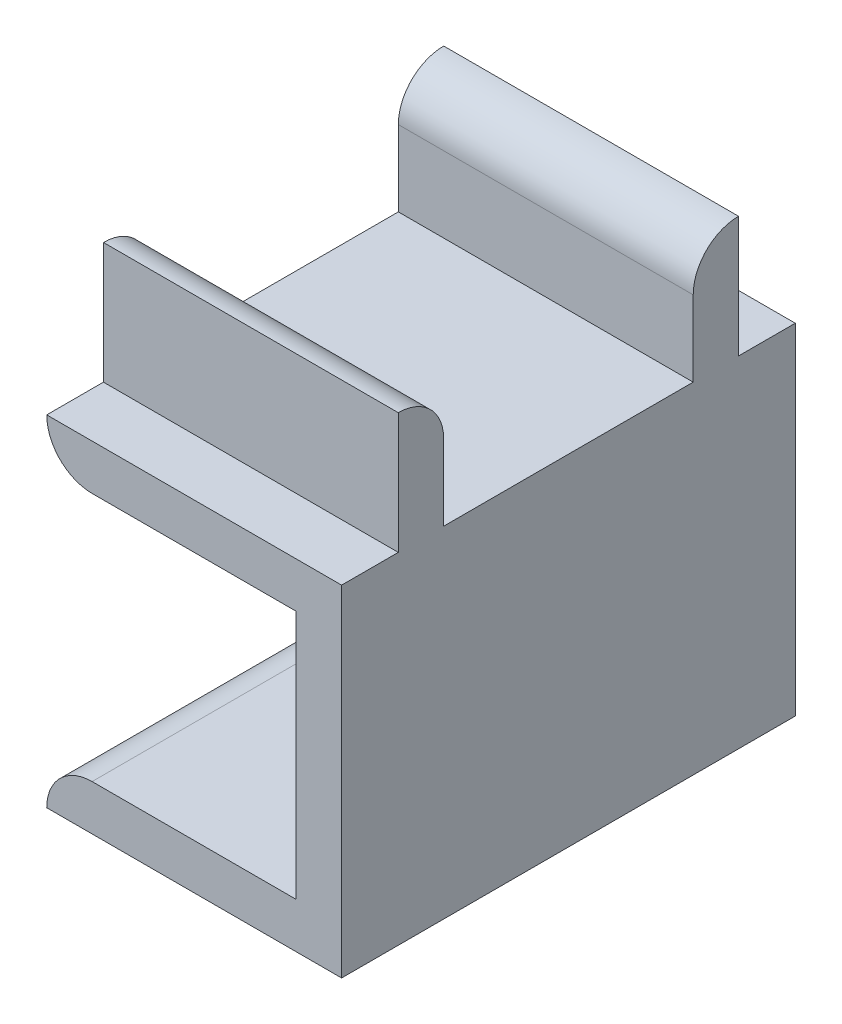
ISO-10303-21;
HEADER;
FILE_DESCRIPTION(('STEP AP214'),'2;1');
FILE_NAME('part.step','',(''),(''),'','','');
FILE_SCHEMA(('AUTOMOTIVE_DESIGN { 1 0 10303 214 1 1 1 1 }'));
ENDSEC;
DATA;
#1=APPLICATION_CONTEXT('core data for automotive mechanical design processes');
#2=APPLICATION_PROTOCOL_DEFINITION('international standard','automotive_design',2000,#1);
#3=PRODUCT_CONTEXT('',#1,'mechanical');
#4=PRODUCT('Part','Part','',(#3));
#5=PRODUCT_RELATED_PRODUCT_CATEGORY('part','',(#4));
#6=PRODUCT_DEFINITION_FORMATION('','',#4);
#7=PRODUCT_DEFINITION_CONTEXT('part definition',#1,'design');
#8=PRODUCT_DEFINITION('design','',#6,#7);
#9=PRODUCT_DEFINITION_SHAPE('','',#8);
#10=(LENGTH_UNIT() NAMED_UNIT(*) SI_UNIT(.MILLI.,.METRE.));
#11=(NAMED_UNIT(*) PLANE_ANGLE_UNIT() SI_UNIT($,.RADIAN.));
#12=(NAMED_UNIT(*) SI_UNIT($,.STERADIAN.) SOLID_ANGLE_UNIT());
#13=UNCERTAINTY_MEASURE_WITH_UNIT(LENGTH_MEASURE(1.E-05),#10,'distance_accuracy_value','');
#14=(GEOMETRIC_REPRESENTATION_CONTEXT(3) GLOBAL_UNCERTAINTY_ASSIGNED_CONTEXT((#13)) GLOBAL_UNIT_ASSIGNED_CONTEXT((#10,
#11,#12)) REPRESENTATION_CONTEXT('',''));
#15=CARTESIAN_POINT('',(0.,0.,0.));
#16=DIRECTION('',(0.,0.,1.));
#17=DIRECTION('',(1.,0.,0.));
#18=AXIS2_PLACEMENT_3D('',#15,#16,#17);
#19=CARTESIAN_POINT('',(-19.5,22.5,30.));
#20=DIRECTION('',(1.,0.,0.));
#21=DIRECTION('',(0.,0.,-1.));
#22=AXIS2_PLACEMENT_3D('',#19,#20,#21);
#23=PLANE('',#22);
#24=DIRECTION('',(0.,-1.,0.));
#25=VECTOR('',#24,1.);
#26=CARTESIAN_POINT('',(-19.5,30.5,3.75));
#27=LINE('',#26,#25);
#28=CARTESIAN_POINT('',(-19.5,30.5,3.75));
#29=VERTEX_POINT('',#28);
#30=CARTESIAN_POINT('',(-19.5,22.5,3.75));
#31=VERTEX_POINT('',#30);
#32=EDGE_CURVE('E198',#29,#31,#27,.T.);
#33=ORIENTED_EDGE('',*,*,#32,.T.);
#34=DIRECTION('',(0.,0.,-1.));
#35=VECTOR('',#34,1.);
#36=CARTESIAN_POINT('',(-19.5,22.5,30.));
#37=LINE('',#36,#35);
#38=CARTESIAN_POINT('',(-19.5,22.5,6.75));
#39=VERTEX_POINT('',#38);
#40=EDGE_CURVE('E237',#31,#39,#37,.F.);
#41=ORIENTED_EDGE('',*,*,#40,.T.);
#42=DIRECTION('',(0.,-1.,0.));
#43=VECTOR('',#42,1.);
#44=CARTESIAN_POINT('',(-19.5,30.5,6.75));
#45=LINE('',#44,#43);
#46=CARTESIAN_POINT('',(-19.5,27.5,6.75));
#47=VERTEX_POINT('',#46);
#48=EDGE_CURVE('E202',#47,#39,#45,.T.);
#49=ORIENTED_EDGE('',*,*,#48,.F.);
#50=CARTESIAN_POINT('',(-19.5,27.5,3.75));
#51=DIRECTION('',(1.,0.,0.));
#52=DIRECTION('',(0.,0.,-1.));
#53=AXIS2_PLACEMENT_3D('',#50,#51,#52);
#54=CIRCLE('',#53,3.);
#55=EDGE_CURVE('E155',#47,#29,#54,.F.);
#56=ORIENTED_EDGE('',*,*,#55,.T.);
#57=EDGE_LOOP('',(#33,#41,#49,#56));
#58=FACE_BOUND('',#57,.T.);
#59=ADVANCED_FACE('F33',(#58),#23,.F.);
#60=CARTESIAN_POINT('',(0.,22.5,30.));
#61=DIRECTION('',(0.,-1.,0.));
#62=DIRECTION('',(1.,0.,0.));
#63=AXIS2_PLACEMENT_3D('',#60,#61,#62);
#64=PLANE('',#63);
#65=DIRECTION('',(-1.,0.,0.));
#66=VECTOR('',#65,1.);
#67=CARTESIAN_POINT('',(0.,22.5,23.25));
#68=LINE('',#67,#66);
#69=CARTESIAN_POINT('',(0.,22.5,23.25));
#70=VERTEX_POINT('',#69);
#71=CARTESIAN_POINT('',(-19.5,22.5,23.25));
#72=VERTEX_POINT('',#71);
#73=EDGE_CURVE('E173',#70,#72,#68,.T.);
#74=ORIENTED_EDGE('',*,*,#73,.F.);
#75=DIRECTION('',(0.,0.,-1.));
#76=VECTOR('',#75,1.);
#77=CARTESIAN_POINT('',(0.,22.5,30.));
#78=LINE('',#77,#76);
#79=CARTESIAN_POINT('',(0.,22.5,6.75));
#80=VERTEX_POINT('',#79);
#81=EDGE_CURVE('E219',#70,#80,#78,.T.);
#82=ORIENTED_EDGE('',*,*,#81,.T.);
#83=DIRECTION('',(1.,0.,0.));
#84=VECTOR('',#83,1.);
#85=CARTESIAN_POINT('',(0.,22.5,6.75));
#86=LINE('',#85,#84);
#87=EDGE_CURVE('E186',#39,#80,#86,.T.);
#88=ORIENTED_EDGE('',*,*,#87,.F.);
#89=DIRECTION('',(0.,0.,-1.));
#90=VECTOR('',#89,1.);
#91=CARTESIAN_POINT('',(-19.5,22.5,30.));
#92=LINE('',#91,#90);
#93=EDGE_CURVE('E304',#72,#39,#92,.T.);
#94=ORIENTED_EDGE('',*,*,#93,.F.);
#95=EDGE_LOOP('',(#74,#82,#88,#94));
#96=FACE_BOUND('',#95,.T.);
#97=ADVANCED_FACE('F318',(#96),#64,.F.);
#98=DIRECTION('',(1.,0.,0.));
#99=VECTOR('',#98,1.);
#100=CARTESIAN_POINT('',(0.,22.5,26.25));
#101=LINE('',#100,#99);
#102=CARTESIAN_POINT('',(-19.5,22.5,26.25));
#103=VERTEX_POINT('',#102);
#104=CARTESIAN_POINT('',(0.,22.5,26.25));
#105=VERTEX_POINT('',#104);
#106=EDGE_CURVE('E170',#103,#105,#101,.T.);
#107=ORIENTED_EDGE('',*,*,#106,.F.);
#108=CARTESIAN_POINT('',(-19.5,22.5,30.));
#109=VERTEX_POINT('',#108);
#110=EDGE_CURVE('E303',#109,#103,#92,.T.);
#111=ORIENTED_EDGE('',*,*,#110,.F.);
#112=DIRECTION('',(-1.,0.,0.));
#113=VECTOR('',#112,1.);
#114=CARTESIAN_POINT('',(0.,22.5,30.));
#115=LINE('',#114,#113);
#116=CARTESIAN_POINT('',(0.,22.5,30.));
#117=VERTEX_POINT('',#116);
#118=EDGE_CURVE('E250',#117,#109,#115,.T.);
#119=ORIENTED_EDGE('',*,*,#118,.F.);
#120=EDGE_CURVE('E306',#117,#105,#78,.T.);
#121=ORIENTED_EDGE('',*,*,#120,.T.);
#122=EDGE_LOOP('',(#107,#111,#119,#121));
#123=FACE_BOUND('',#122,.T.);
#124=ADVANCED_FACE('F355',(#123),#64,.F.);
#125=DIRECTION('',(-1.,0.,0.));
#126=VECTOR('',#125,1.);
#127=CARTESIAN_POINT('',(0.,22.5,3.75));
#128=LINE('',#127,#126);
#129=CARTESIAN_POINT('',(0.,22.5,3.75));
#130=VERTEX_POINT('',#129);
#131=EDGE_CURVE('E181',#130,#31,#128,.T.);
#132=ORIENTED_EDGE('',*,*,#131,.F.);
#133=CARTESIAN_POINT('',(0.,22.5,0.));
#134=VERTEX_POINT('',#133);
#135=EDGE_CURVE('E195',#130,#134,#78,.T.);
#136=ORIENTED_EDGE('',*,*,#135,.T.);
#137=DIRECTION('',(-1.,0.,0.));
#138=VECTOR('',#137,1.);
#139=CARTESIAN_POINT('',(0.,22.5,0.));
#140=LINE('',#139,#138);
#141=CARTESIAN_POINT('',(-19.5,22.5,0.));
#142=VERTEX_POINT('',#141);
#143=EDGE_CURVE('E270',#134,#142,#140,.T.);
#144=ORIENTED_EDGE('',*,*,#143,.T.);
#145=EDGE_CURVE('E266',#31,#142,#92,.T.);
#146=ORIENTED_EDGE('',*,*,#145,.F.);
#147=EDGE_LOOP('',(#132,#136,#144,#146));
#148=FACE_BOUND('',#147,.T.);
#149=ADVANCED_FACE('F274',(#148),#64,.F.);
#150=CARTESIAN_POINT('',(-19.5,0.,30.));
#151=DIRECTION('',(0.,1.,0.));
#152=DIRECTION('',(0.,0.,1.));
#153=AXIS2_PLACEMENT_3D('',#150,#151,#152);
#154=PLANE('',#153);
#155=DIRECTION('',(1.,0.,0.));
#156=VECTOR('',#155,1.);
#157=CARTESIAN_POINT('',(-19.5,0.,0.));
#158=LINE('',#157,#156);
#159=CARTESIAN_POINT('',(-19.5,0.,0.));
#160=VERTEX_POINT('',#159);
#161=CARTESIAN_POINT('',(0.,0.,0.));
#162=VERTEX_POINT('',#161);
#163=EDGE_CURVE('E207',#160,#162,#158,.T.);
#164=ORIENTED_EDGE('',*,*,#163,.T.);
#165=DIRECTION('',(0.,0.,-1.));
#166=VECTOR('',#165,1.);
#167=CARTESIAN_POINT('',(0.,0.,30.));
#168=LINE('',#167,#166);
#169=CARTESIAN_POINT('',(0.,0.,30.));
#170=VERTEX_POINT('',#169);
#171=EDGE_CURVE('E223',#170,#162,#168,.T.);
#172=ORIENTED_EDGE('',*,*,#171,.F.);
#173=DIRECTION('',(1.,0.,0.));
#174=VECTOR('',#173,1.);
#175=CARTESIAN_POINT('',(-19.5,0.,30.));
#176=LINE('',#175,#174);
#177=CARTESIAN_POINT('',(-19.5,0.,30.));
#178=VERTEX_POINT('',#177);
#179=EDGE_CURVE('E287',#178,#170,#176,.T.);
#180=ORIENTED_EDGE('',*,*,#179,.F.);
#181=DIRECTION('',(0.,0.,-1.));
#182=VECTOR('',#181,1.);
#183=CARTESIAN_POINT('',(-19.5,0.,30.));
#184=LINE('',#183,#182);
#185=EDGE_CURVE('E288',#178,#160,#184,.T.);
#186=ORIENTED_EDGE('',*,*,#185,.T.);
#187=EDGE_LOOP('',(#164,#172,#180,#186));
#188=FACE_BOUND('',#187,.T.);
#189=ADVANCED_FACE('F347',(#188),#154,.F.);
#190=CARTESIAN_POINT('',(0.,0.,30.));
#191=DIRECTION('',(-1.,0.,0.));
#192=DIRECTION('',(0.,0.,1.));
#193=AXIS2_PLACEMENT_3D('',#190,#191,#192);
#194=PLANE('',#193);
#195=DIRECTION('',(0.,-1.,0.));
#196=VECTOR('',#195,1.);
#197=CARTESIAN_POINT('',(0.,30.5,23.25));
#198=LINE('',#197,#196);
#199=CARTESIAN_POINT('',(0.,27.5,23.25));
#200=VERTEX_POINT('',#199);
#201=EDGE_CURVE('E179',#200,#70,#198,.T.);
#202=ORIENTED_EDGE('',*,*,#201,.F.);
#203=CARTESIAN_POINT('',(0.,27.5,26.25));
#204=DIRECTION('',(-1.,0.,0.));
#205=DIRECTION('',(0.,0.,1.));
#206=AXIS2_PLACEMENT_3D('',#203,#204,#205);
#207=CIRCLE('',#206,3.);
#208=CARTESIAN_POINT('',(0.,30.5,26.25));
#209=VERTEX_POINT('',#208);
#210=EDGE_CURVE('E229',#200,#209,#207,.F.);
#211=ORIENTED_EDGE('',*,*,#210,.T.);
#212=DIRECTION('',(0.,-1.,0.));
#213=VECTOR('',#212,1.);
#214=CARTESIAN_POINT('',(0.,30.5,26.25));
#215=LINE('',#214,#213);
#216=EDGE_CURVE('E165',#209,#105,#215,.T.);
#217=ORIENTED_EDGE('',*,*,#216,.T.);
#218=ORIENTED_EDGE('',*,*,#120,.F.);
#219=DIRECTION('',(0.,1.,0.));
#220=VECTOR('',#219,1.);
#221=CARTESIAN_POINT('',(0.,0.,30.));
#222=LINE('',#221,#220);
#223=EDGE_CURVE('E342',#170,#117,#222,.T.);
#224=ORIENTED_EDGE('',*,*,#223,.F.);
#225=ORIENTED_EDGE('',*,*,#171,.T.);
#226=DIRECTION('',(0.,1.,0.));
#227=VECTOR('',#226,1.);
#228=CARTESIAN_POINT('',(0.,0.,0.));
#229=LINE('',#228,#227);
#230=EDGE_CURVE('E277',#162,#134,#229,.T.);
#231=ORIENTED_EDGE('',*,*,#230,.T.);
#232=ORIENTED_EDGE('',*,*,#135,.F.);
#233=DIRECTION('',(0.,-1.,0.));
#234=VECTOR('',#233,1.);
#235=CARTESIAN_POINT('',(0.,30.5,3.75));
#236=LINE('',#235,#234);
#237=CARTESIAN_POINT('',(0.,30.5,3.75));
#238=VERTEX_POINT('',#237);
#239=EDGE_CURVE('E201',#238,#130,#236,.T.);
#240=ORIENTED_EDGE('',*,*,#239,.F.);
#241=CARTESIAN_POINT('',(0.,27.5,3.75));
#242=DIRECTION('',(-1.,0.,0.));
#243=DIRECTION('',(0.,0.,1.));
#244=AXIS2_PLACEMENT_3D('',#241,#242,#243);
#245=CIRCLE('',#244,3.);
#246=CARTESIAN_POINT('',(0.,27.5,6.75));
#247=VERTEX_POINT('',#246);
#248=EDGE_CURVE('E220',#238,#247,#245,.F.);
#249=ORIENTED_EDGE('',*,*,#248,.T.);
#250=DIRECTION('',(0.,-1.,0.));
#251=VECTOR('',#250,1.);
#252=CARTESIAN_POINT('',(0.,30.5,6.75));
#253=LINE('',#252,#251);
#254=EDGE_CURVE('E185',#247,#80,#253,.T.);
#255=ORIENTED_EDGE('',*,*,#254,.T.);
#256=ORIENTED_EDGE('',*,*,#81,.F.);
#257=EDGE_LOOP('',(#202,#211,#217,#218,#224,#225,#231,#232,#240,#249,#255,#256));
#258=FACE_BOUND('',#257,.T.);
#259=ADVANCED_FACE('F336',(#258),#194,.F.);
#260=DIRECTION('',(0.,-1.,0.));
#261=VECTOR('',#260,1.);
#262=CARTESIAN_POINT('',(-19.5,30.5,23.25));
#263=LINE('',#262,#261);
#264=CARTESIAN_POINT('',(-19.5,27.5,23.25));
#265=VERTEX_POINT('',#264);
#266=EDGE_CURVE('E164',#265,#72,#263,.T.);
#267=ORIENTED_EDGE('',*,*,#266,.T.);
#268=DIRECTION('',(0.,0.,-1.));
#269=VECTOR('',#268,1.);
#270=CARTESIAN_POINT('',(-19.5,22.5,30.));
#271=LINE('',#270,#269);
#272=EDGE_CURVE('E161',#72,#103,#271,.F.);
#273=ORIENTED_EDGE('',*,*,#272,.T.);
#274=DIRECTION('',(0.,-1.,0.));
#275=VECTOR('',#274,1.);
#276=CARTESIAN_POINT('',(-19.5,30.5,26.25));
#277=LINE('',#276,#275);
#278=CARTESIAN_POINT('',(-19.5,30.5,26.25));
#279=VERTEX_POINT('',#278);
#280=EDGE_CURVE('E158',#279,#103,#277,.T.);
#281=ORIENTED_EDGE('',*,*,#280,.F.);
#282=CARTESIAN_POINT('',(-19.5,27.5,26.25));
#283=DIRECTION('',(1.,0.,0.));
#284=DIRECTION('',(0.,0.,-1.));
#285=AXIS2_PLACEMENT_3D('',#282,#283,#284);
#286=CIRCLE('',#285,3.);
#287=EDGE_CURVE('E146',#279,#265,#286,.F.);
#288=ORIENTED_EDGE('',*,*,#287,.T.);
#289=EDGE_LOOP('',(#267,#273,#281,#288));
#290=FACE_BOUND('',#289,.T.);
#291=ADVANCED_FACE('F159',(#290),#23,.F.);
#292=CARTESIAN_POINT('',(-19.5,19.5,30.));
#293=DIRECTION('',(0.,1.,0.));
#294=DIRECTION('',(0.,0.,1.));
#295=AXIS2_PLACEMENT_3D('',#292,#293,#294);
#296=PLANE('',#295);
#297=DIRECTION('',(1.,0.,0.));
#298=VECTOR('',#297,1.);
#299=CARTESIAN_POINT('',(-19.5,19.5,30.));
#300=LINE('',#299,#298);
#301=CARTESIAN_POINT('',(-16.5,19.5,30.));
#302=VERTEX_POINT('',#301);
#303=CARTESIAN_POINT('',(-3.,19.5,30.));
#304=VERTEX_POINT('',#303);
#305=EDGE_CURVE('E247',#302,#304,#300,.T.);
#306=ORIENTED_EDGE('',*,*,#305,.F.);
#307=DIRECTION('',(0.,0.,-1.));
#308=VECTOR('',#307,1.);
#309=CARTESIAN_POINT('',(-16.5,19.5,30.));
#310=LINE('',#309,#308);
#311=CARTESIAN_POINT('',(-16.5,19.5,0.));
#312=VERTEX_POINT('',#311);
#313=EDGE_CURVE('E231',#302,#312,#310,.T.);
#314=ORIENTED_EDGE('',*,*,#313,.T.);
#315=DIRECTION('',(1.,0.,0.));
#316=VECTOR('',#315,1.);
#317=CARTESIAN_POINT('',(-19.5,19.5,0.));
#318=LINE('',#317,#316);
#319=CARTESIAN_POINT('',(-3.,19.5,0.));
#320=VERTEX_POINT('',#319);
#321=EDGE_CURVE('E272',#312,#320,#318,.T.);
#322=ORIENTED_EDGE('',*,*,#321,.T.);
#323=DIRECTION('',(0.,0.,-1.));
#324=VECTOR('',#323,1.);
#325=CARTESIAN_POINT('',(-3.,19.5,30.));
#326=LINE('',#325,#324);
#327=EDGE_CURVE('E259',#304,#320,#326,.T.);
#328=ORIENTED_EDGE('',*,*,#327,.F.);
#329=EDGE_LOOP('',(#306,#314,#322,#328));
#330=FACE_BOUND('',#329,.T.);
#331=ADVANCED_FACE('F256',(#330),#296,.F.);
#332=CARTESIAN_POINT('',(-3.,19.5,30.));
#333=DIRECTION('',(1.,0.,0.));
#334=DIRECTION('',(0.,1.,0.));
#335=AXIS2_PLACEMENT_3D('',#332,#333,#334);
#336=PLANE('',#335);
#337=DIRECTION('',(0.,-1.,0.));
#338=VECTOR('',#337,1.);
#339=CARTESIAN_POINT('',(-3.,19.5,0.));
#340=LINE('',#339,#338);
#341=CARTESIAN_POINT('',(-3.,3.,0.));
#342=VERTEX_POINT('',#341);
#343=EDGE_CURVE('E279',#320,#342,#340,.T.);
#344=ORIENTED_EDGE('',*,*,#343,.T.);
#345=DIRECTION('',(0.,0.,-1.));
#346=VECTOR('',#345,1.);
#347=CARTESIAN_POINT('',(-3.,3.,30.));
#348=LINE('',#347,#346);
#349=CARTESIAN_POINT('',(-3.,3.,30.));
#350=VERTEX_POINT('',#349);
#351=EDGE_CURVE('E291',#350,#342,#348,.T.);
#352=ORIENTED_EDGE('',*,*,#351,.F.);
#353=DIRECTION('',(0.,-1.,0.));
#354=VECTOR('',#353,1.);
#355=CARTESIAN_POINT('',(-3.,19.5,30.));
#356=LINE('',#355,#354);
#357=EDGE_CURVE('E261',#304,#350,#356,.T.);
#358=ORIENTED_EDGE('',*,*,#357,.F.);
#359=ORIENTED_EDGE('',*,*,#327,.T.);
#360=EDGE_LOOP('',(#344,#352,#358,#359));
#361=FACE_BOUND('',#360,.T.);
#362=ADVANCED_FACE('F368',(#361),#336,.F.);
#363=CARTESIAN_POINT('',(-3.,3.,30.));
#364=DIRECTION('',(0.,-1.,0.));
#365=DIRECTION('',(1.,0.,0.));
#366=AXIS2_PLACEMENT_3D('',#363,#364,#365);
#367=PLANE('',#366);
#368=DIRECTION('',(-1.,0.,0.));
#369=VECTOR('',#368,1.);
#370=CARTESIAN_POINT('',(-3.,3.,0.));
#371=LINE('',#370,#369);
#372=CARTESIAN_POINT('',(-16.5,3.,0.));
#373=VERTEX_POINT('',#372);
#374=EDGE_CURVE('E285',#342,#373,#371,.T.);
#375=ORIENTED_EDGE('',*,*,#374,.T.);
#376=DIRECTION('',(0.,0.,-1.));
#377=VECTOR('',#376,1.);
#378=CARTESIAN_POINT('',(-16.5,3.,30.));
#379=LINE('',#378,#377);
#380=CARTESIAN_POINT('',(-16.5,3.,30.));
#381=VERTEX_POINT('',#380);
#382=EDGE_CURVE('E41',#373,#381,#379,.F.);
#383=ORIENTED_EDGE('',*,*,#382,.T.);
#384=DIRECTION('',(-1.,0.,0.));
#385=VECTOR('',#384,1.);
#386=CARTESIAN_POINT('',(-3.,3.,30.));
#387=LINE('',#386,#385);
#388=EDGE_CURVE('E292',#350,#381,#387,.T.);
#389=ORIENTED_EDGE('',*,*,#388,.F.);
#390=ORIENTED_EDGE('',*,*,#351,.T.);
#391=EDGE_LOOP('',(#375,#383,#389,#390));
#392=FACE_BOUND('',#391,.T.);
#393=ADVANCED_FACE('F372',(#392),#367,.F.);
#394=CARTESIAN_POINT('',(0.,0.,30.));
#395=DIRECTION('',(0.,0.,1.));
#396=DIRECTION('',(1.,0.,0.));
#397=AXIS2_PLACEMENT_3D('',#394,#395,#396);
#398=PLANE('',#397);
#399=ORIENTED_EDGE('',*,*,#388,.T.);
#400=CARTESIAN_POINT('',(-16.5,0.,30.));
#401=DIRECTION('',(0.,0.,1.));
#402=DIRECTION('',(1.,0.,0.));
#403=AXIS2_PLACEMENT_3D('',#400,#401,#402);
#404=CIRCLE('',#403,3.);
#405=EDGE_CURVE('E11',#381,#178,#404,.T.);
#406=ORIENTED_EDGE('',*,*,#405,.T.);
#407=ORIENTED_EDGE('',*,*,#179,.T.);
#408=ORIENTED_EDGE('',*,*,#223,.T.);
#409=ORIENTED_EDGE('',*,*,#118,.T.);
#410=CARTESIAN_POINT('',(-16.5,22.5,30.));
#411=DIRECTION('',(0.,0.,1.));
#412=DIRECTION('',(1.,0.,0.));
#413=AXIS2_PLACEMENT_3D('',#410,#411,#412);
#414=CIRCLE('',#413,3.);
#415=EDGE_CURVE('E239',#109,#302,#414,.T.);
#416=ORIENTED_EDGE('',*,*,#415,.T.);
#417=ORIENTED_EDGE('',*,*,#305,.T.);
#418=ORIENTED_EDGE('',*,*,#357,.T.);
#419=EDGE_LOOP('',(#399,#406,#407,#408,#409,#416,#417,#418));
#420=FACE_BOUND('',#419,.T.);
#421=ADVANCED_FACE('F246',(#420),#398,.T.);
#422=CARTESIAN_POINT('',(0.,0.,0.));
#423=DIRECTION('',(0.,0.,1.));
#424=DIRECTION('',(1.,0.,0.));
#425=AXIS2_PLACEMENT_3D('',#422,#423,#424);
#426=PLANE('',#425);
#427=ORIENTED_EDGE('',*,*,#163,.F.);
#428=CARTESIAN_POINT('',(-16.5,0.,0.));
#429=DIRECTION('',(0.,0.,1.));
#430=DIRECTION('',(1.,0.,0.));
#431=AXIS2_PLACEMENT_3D('',#428,#429,#430);
#432=CIRCLE('',#431,3.);
#433=EDGE_CURVE('E55',#160,#373,#432,.F.);
#434=ORIENTED_EDGE('',*,*,#433,.T.);
#435=ORIENTED_EDGE('',*,*,#374,.F.);
#436=ORIENTED_EDGE('',*,*,#343,.F.);
#437=ORIENTED_EDGE('',*,*,#321,.F.);
#438=CARTESIAN_POINT('',(-16.5,22.5,0.));
#439=DIRECTION('',(0.,0.,1.));
#440=DIRECTION('',(1.,0.,0.));
#441=AXIS2_PLACEMENT_3D('',#438,#439,#440);
#442=CIRCLE('',#441,3.);
#443=EDGE_CURVE('E234',#312,#142,#442,.F.);
#444=ORIENTED_EDGE('',*,*,#443,.T.);
#445=ORIENTED_EDGE('',*,*,#143,.F.);
#446=ORIENTED_EDGE('',*,*,#230,.F.);
#447=EDGE_LOOP('',(#427,#434,#435,#436,#437,#444,#445,#446));
#448=FACE_BOUND('',#447,.T.);
#449=ADVANCED_FACE('F269',(#448),#426,.F.);
#450=CARTESIAN_POINT('',(0.,30.5,3.75));
#451=DIRECTION('',(0.,0.,1.));
#452=DIRECTION('',(1.,0.,0.));
#453=AXIS2_PLACEMENT_3D('',#450,#451,#452);
#454=PLANE('',#453);
#455=ORIENTED_EDGE('',*,*,#131,.T.);
#456=ORIENTED_EDGE('',*,*,#32,.F.);
#457=DIRECTION('',(-1.,0.,0.));
#458=VECTOR('',#457,1.);
#459=CARTESIAN_POINT('',(0.,30.5,3.75));
#460=LINE('',#459,#458);
#461=EDGE_CURVE('E182',#238,#29,#460,.T.);
#462=ORIENTED_EDGE('',*,*,#461,.F.);
#463=ORIENTED_EDGE('',*,*,#239,.T.);
#464=EDGE_LOOP('',(#455,#456,#462,#463));
#465=FACE_BOUND('',#464,.T.);
#466=ADVANCED_FACE('F335',(#465),#454,.F.);
#467=CARTESIAN_POINT('',(0.,30.5,6.75));
#468=DIRECTION('',(0.,0.,-1.));
#469=DIRECTION('',(-1.,0.,0.));
#470=AXIS2_PLACEMENT_3D('',#467,#468,#469);
#471=PLANE('',#470);
#472=ORIENTED_EDGE('',*,*,#254,.F.);
#473=DIRECTION('',(1.,0.,0.));
#474=VECTOR('',#473,1.);
#475=CARTESIAN_POINT('',(0.,27.5,6.75));
#476=LINE('',#475,#474);
#477=EDGE_CURVE('E222',#247,#47,#476,.F.);
#478=ORIENTED_EDGE('',*,*,#477,.T.);
#479=ORIENTED_EDGE('',*,*,#48,.T.);
#480=ORIENTED_EDGE('',*,*,#87,.T.);
#481=EDGE_LOOP('',(#472,#478,#479,#480));
#482=FACE_BOUND('',#481,.T.);
#483=ADVANCED_FACE('F324',(#482),#471,.F.);
#484=CARTESIAN_POINT('',(0.,30.5,23.25));
#485=DIRECTION('',(0.,0.,1.));
#486=DIRECTION('',(1.,0.,0.));
#487=AXIS2_PLACEMENT_3D('',#484,#485,#486);
#488=PLANE('',#487);
#489=ORIENTED_EDGE('',*,*,#266,.F.);
#490=DIRECTION('',(-1.,0.,0.));
#491=VECTOR('',#490,1.);
#492=CARTESIAN_POINT('',(0.,27.5,23.25));
#493=LINE('',#492,#491);
#494=EDGE_CURVE('E152',#265,#200,#493,.F.);
#495=ORIENTED_EDGE('',*,*,#494,.T.);
#496=ORIENTED_EDGE('',*,*,#201,.T.);
#497=ORIENTED_EDGE('',*,*,#73,.T.);
#498=EDGE_LOOP('',(#489,#495,#496,#497));
#499=FACE_BOUND('',#498,.T.);
#500=ADVANCED_FACE('F386',(#499),#488,.F.);
#501=CARTESIAN_POINT('',(0.,30.5,26.25));
#502=DIRECTION('',(0.,0.,-1.));
#503=DIRECTION('',(-1.,0.,0.));
#504=AXIS2_PLACEMENT_3D('',#501,#502,#503);
#505=PLANE('',#504);
#506=ORIENTED_EDGE('',*,*,#106,.T.);
#507=ORIENTED_EDGE('',*,*,#216,.F.);
#508=DIRECTION('',(1.,0.,0.));
#509=VECTOR('',#508,1.);
#510=CARTESIAN_POINT('',(0.,30.5,26.25));
#511=LINE('',#510,#509);
#512=EDGE_CURVE('E151',#279,#209,#511,.T.);
#513=ORIENTED_EDGE('',*,*,#512,.F.);
#514=ORIENTED_EDGE('',*,*,#280,.T.);
#515=EDGE_LOOP('',(#506,#507,#513,#514));
#516=FACE_BOUND('',#515,.T.);
#517=ADVANCED_FACE('F168',(#516),#505,.F.);
#518=CARTESIAN_POINT('',(0.,27.5,3.75));
#519=DIRECTION('',(1.,0.,0.));
#520=DIRECTION('',(0.,1.,0.));
#521=AXIS2_PLACEMENT_3D('',#518,#519,#520);
#522=CYLINDRICAL_SURFACE('',#521,3.);
#523=ORIENTED_EDGE('',*,*,#55,.F.);
#524=ORIENTED_EDGE('',*,*,#477,.F.);
#525=ORIENTED_EDGE('',*,*,#248,.F.);
#526=ORIENTED_EDGE('',*,*,#461,.T.);
#527=EDGE_LOOP('',(#523,#524,#525,#526));
#528=FACE_BOUND('',#527,.T.);
#529=ADVANCED_FACE('F331',(#528),#522,.T.);
#530=CARTESIAN_POINT('',(0.,27.5,26.25));
#531=DIRECTION('',(-1.,0.,0.));
#532=DIRECTION('',(0.,-1.,0.));
#533=AXIS2_PLACEMENT_3D('',#530,#531,#532);
#534=CYLINDRICAL_SURFACE('',#533,3.);
#535=ORIENTED_EDGE('',*,*,#210,.F.);
#536=ORIENTED_EDGE('',*,*,#494,.F.);
#537=ORIENTED_EDGE('',*,*,#287,.F.);
#538=ORIENTED_EDGE('',*,*,#512,.T.);
#539=EDGE_LOOP('',(#535,#536,#537,#538));
#540=FACE_BOUND('',#539,.T.);
#541=ADVANCED_FACE('F149',(#540),#534,.T.);
#542=CARTESIAN_POINT('',(-16.5,22.5,30.));
#543=DIRECTION('',(0.,0.,-1.));
#544=DIRECTION('',(-1.,0.,0.));
#545=AXIS2_PLACEMENT_3D('',#542,#543,#544);
#546=CYLINDRICAL_SURFACE('',#545,3.);
#547=ORIENTED_EDGE('',*,*,#40,.F.);
#548=ORIENTED_EDGE('',*,*,#145,.T.);
#549=ORIENTED_EDGE('',*,*,#443,.F.);
#550=ORIENTED_EDGE('',*,*,#313,.F.);
#551=ORIENTED_EDGE('',*,*,#415,.F.);
#552=ORIENTED_EDGE('',*,*,#110,.T.);
#553=ORIENTED_EDGE('',*,*,#272,.F.);
#554=ORIENTED_EDGE('',*,*,#93,.T.);
#555=EDGE_LOOP('',(#547,#548,#549,#550,#551,#552,#553,#554));
#556=FACE_BOUND('',#555,.T.);
#557=ADVANCED_FACE('F264',(#556),#546,.T.);
#558=CARTESIAN_POINT('',(-16.5,0.,30.));
#559=DIRECTION('',(0.,0.,-1.));
#560=DIRECTION('',(-1.,0.,0.));
#561=AXIS2_PLACEMENT_3D('',#558,#559,#560);
#562=CYLINDRICAL_SURFACE('',#561,3.);
#563=ORIENTED_EDGE('',*,*,#405,.F.);
#564=ORIENTED_EDGE('',*,*,#382,.F.);
#565=ORIENTED_EDGE('',*,*,#433,.F.);
#566=ORIENTED_EDGE('',*,*,#185,.F.);
#567=EDGE_LOOP('',(#563,#564,#565,#566));
#568=FACE_BOUND('',#567,.T.);
#569=ADVANCED_FACE('F35',(#568),#562,.T.);
#570=CLOSED_SHELL('',(#59,#97,#124,#149,#189,#259,#291,#331,#362,#393,#421,#449,#466,#483,#500,
#517,#529,#541,#557,#569));
#571=MANIFOLD_SOLID_BREP('B2',#570);
#572=ADVANCED_BREP_SHAPE_REPRESENTATION('',(#18,#571),#14);
#573=SHAPE_DEFINITION_REPRESENTATION(#9,#572);
ENDSEC;
END-ISO-10303-21;
